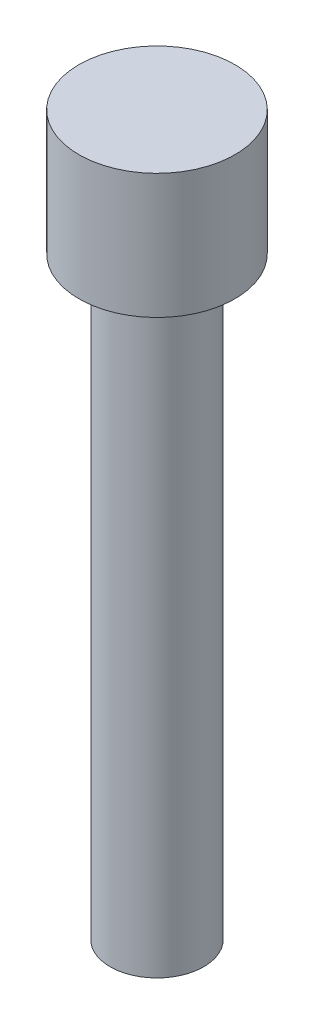
ISO-10303-21;
HEADER;
FILE_DESCRIPTION(('STEP AP214'),'2;1');
FILE_NAME('part.step','',(''),(''),'','','');
FILE_SCHEMA(('AUTOMOTIVE_DESIGN { 1 0 10303 214 1 1 1 1 }'));
ENDSEC;
DATA;
#1=APPLICATION_CONTEXT('core data for automotive mechanical design processes');
#2=APPLICATION_PROTOCOL_DEFINITION('international standard','automotive_design',2000,#1);
#3=PRODUCT_CONTEXT('',#1,'mechanical');
#4=PRODUCT('Part','Part','',(#3));
#5=PRODUCT_RELATED_PRODUCT_CATEGORY('part','',(#4));
#6=PRODUCT_DEFINITION_FORMATION('','',#4);
#7=PRODUCT_DEFINITION_CONTEXT('part definition',#1,'design');
#8=PRODUCT_DEFINITION('design','',#6,#7);
#9=PRODUCT_DEFINITION_SHAPE('','',#8);
#10=(LENGTH_UNIT() NAMED_UNIT(*) SI_UNIT(.MILLI.,.METRE.));
#11=(NAMED_UNIT(*) PLANE_ANGLE_UNIT() SI_UNIT($,.RADIAN.));
#12=(NAMED_UNIT(*) SI_UNIT($,.STERADIAN.) SOLID_ANGLE_UNIT());
#13=UNCERTAINTY_MEASURE_WITH_UNIT(LENGTH_MEASURE(1.E-05),#10,'distance_accuracy_value','');
#14=(GEOMETRIC_REPRESENTATION_CONTEXT(3) GLOBAL_UNCERTAINTY_ASSIGNED_CONTEXT((#13)) GLOBAL_UNIT_ASSIGNED_CONTEXT((#10,
#11,#12)) REPRESENTATION_CONTEXT('',''));
#15=CARTESIAN_POINT('',(0.,0.,0.));
#16=DIRECTION('',(0.,0.,1.));
#17=DIRECTION('',(1.,0.,0.));
#18=AXIS2_PLACEMENT_3D('',#15,#16,#17);
#19=CARTESIAN_POINT('',(-59.3995387922492,254.868738955257,183.810017211971));
#20=DIRECTION('',(0.,-1.,0.));
#21=DIRECTION('',(1.,0.,0.));
#22=AXIS2_PLACEMENT_3D('',#19,#20,#21);
#23=CYLINDRICAL_SURFACE('',#22,1.50000000000006);
#24=CARTESIAN_POINT('',(-59.3995387922492,250.626098268138,183.810017211971));
#25=DIRECTION('',(0.,1.,0.));
#26=DIRECTION('',(-1.,0.,0.));
#27=AXIS2_PLACEMENT_3D('',#24,#25,#26);
#28=CIRCLE('',#27,1.50000000000006);
#29=CARTESIAN_POINT('',(-60.8995387922492,250.626098268138,183.810017211971));
#30=VERTEX_POINT('',#29);
#31=EDGE_CURVE('E10',#30,#30,#28,.T.);
#32=ORIENTED_EDGE('',*,*,#31,.F.);
#33=EDGE_LOOP('',(#32));
#34=FACE_BOUND('',#33,.T.);
#35=CARTESIAN_POINT('',(-59.3995387922492,231.593099077973,183.810017211971));
#36=DIRECTION('',(0.,1.,0.));
#37=DIRECTION('',(-1.,0.,0.));
#38=AXIS2_PLACEMENT_3D('',#35,#36,#37);
#39=CIRCLE('',#38,1.50000000000006);
#40=CARTESIAN_POINT('',(-60.8995387922492,231.593099077973,183.810017211971));
#41=VERTEX_POINT('',#40);
#42=EDGE_CURVE('E37',#41,#41,#39,.T.);
#43=ORIENTED_EDGE('',*,*,#42,.T.);
#44=EDGE_LOOP('',(#43));
#45=FACE_BOUND('',#44,.T.);
#46=ADVANCED_FACE('F31',(#34,#45),#23,.T.);
#47=CARTESIAN_POINT('',(-59.3995387922492,231.593099077973,183.810017211971));
#48=DIRECTION('',(0.,1.,0.));
#49=DIRECTION('',(-1.,0.,0.));
#50=AXIS2_PLACEMENT_3D('',#47,#48,#49);
#51=PLANE('',#50);
#52=ORIENTED_EDGE('',*,*,#42,.F.);
#53=EDGE_LOOP('',(#52));
#54=FACE_BOUND('',#53,.T.);
#55=ADVANCED_FACE('F64',(#54),#51,.F.);
#56=CARTESIAN_POINT('',(-59.3995387922492,254.626098268138,183.810017211971));
#57=DIRECTION('',(0.,-1.,0.));
#58=DIRECTION('',(1.,0.,0.));
#59=AXIS2_PLACEMENT_3D('',#56,#57,#58);
#60=CYLINDRICAL_SURFACE('',#59,2.5);
#61=CARTESIAN_POINT('',(-59.3995387922492,254.626098268138,183.810017211971));
#62=DIRECTION('',(0.,1.,0.));
#63=DIRECTION('',(-1.,0.,0.));
#64=AXIS2_PLACEMENT_3D('',#61,#62,#63);
#65=CIRCLE('',#64,2.5);
#66=CARTESIAN_POINT('',(-61.8995387922492,254.626098268138,183.810017211971));
#67=VERTEX_POINT('',#66);
#68=EDGE_CURVE('E41',#67,#67,#65,.T.);
#69=ORIENTED_EDGE('',*,*,#68,.F.);
#70=EDGE_LOOP('',(#69));
#71=FACE_BOUND('',#70,.T.);
#72=CARTESIAN_POINT('',(-59.3995387922492,250.626098268138,183.810017211971));
#73=DIRECTION('',(0.,1.,0.));
#74=DIRECTION('',(-1.,0.,0.));
#75=AXIS2_PLACEMENT_3D('',#72,#73,#74);
#76=CIRCLE('',#75,2.5);
#77=CARTESIAN_POINT('',(-61.8995387922492,250.626098268138,183.810017211971));
#78=VERTEX_POINT('',#77);
#79=EDGE_CURVE('E45',#78,#78,#76,.T.);
#80=ORIENTED_EDGE('',*,*,#79,.T.);
#81=EDGE_LOOP('',(#80));
#82=FACE_BOUND('',#81,.T.);
#83=ADVANCED_FACE('F51',(#71,#82),#60,.T.);
#84=CARTESIAN_POINT('',(-59.3995387922492,254.626098268138,183.810017211971));
#85=DIRECTION('',(0.,1.,0.));
#86=DIRECTION('',(-1.,0.,0.));
#87=AXIS2_PLACEMENT_3D('',#84,#85,#86);
#88=PLANE('',#87);
#89=ORIENTED_EDGE('',*,*,#68,.T.);
#90=EDGE_LOOP('',(#89));
#91=FACE_BOUND('',#90,.T.);
#92=ADVANCED_FACE('F55',(#91),#88,.T.);
#93=CARTESIAN_POINT('',(-59.3995387922492,250.626098268138,183.810017211971));
#94=DIRECTION('',(0.,1.,0.));
#95=DIRECTION('',(-1.,0.,0.));
#96=AXIS2_PLACEMENT_3D('',#93,#94,#95);
#97=PLANE('',#96);
#98=ORIENTED_EDGE('',*,*,#31,.T.);
#99=EDGE_LOOP('',(#98));
#100=FACE_BOUND('',#99,.T.);
#101=ORIENTED_EDGE('',*,*,#79,.F.);
#102=EDGE_LOOP('',(#101));
#103=FACE_BOUND('',#102,.T.);
#104=ADVANCED_FACE('F53',(#100,#103),#97,.F.);
#105=CLOSED_SHELL('',(#46,#55,#83,#92,#104));
#106=MANIFOLD_SOLID_BREP('B2',#105);
#107=ADVANCED_BREP_SHAPE_REPRESENTATION('',(#18,#106),#14);
#108=SHAPE_DEFINITION_REPRESENTATION(#9,#107);
ENDSEC;
END-ISO-10303-21;
